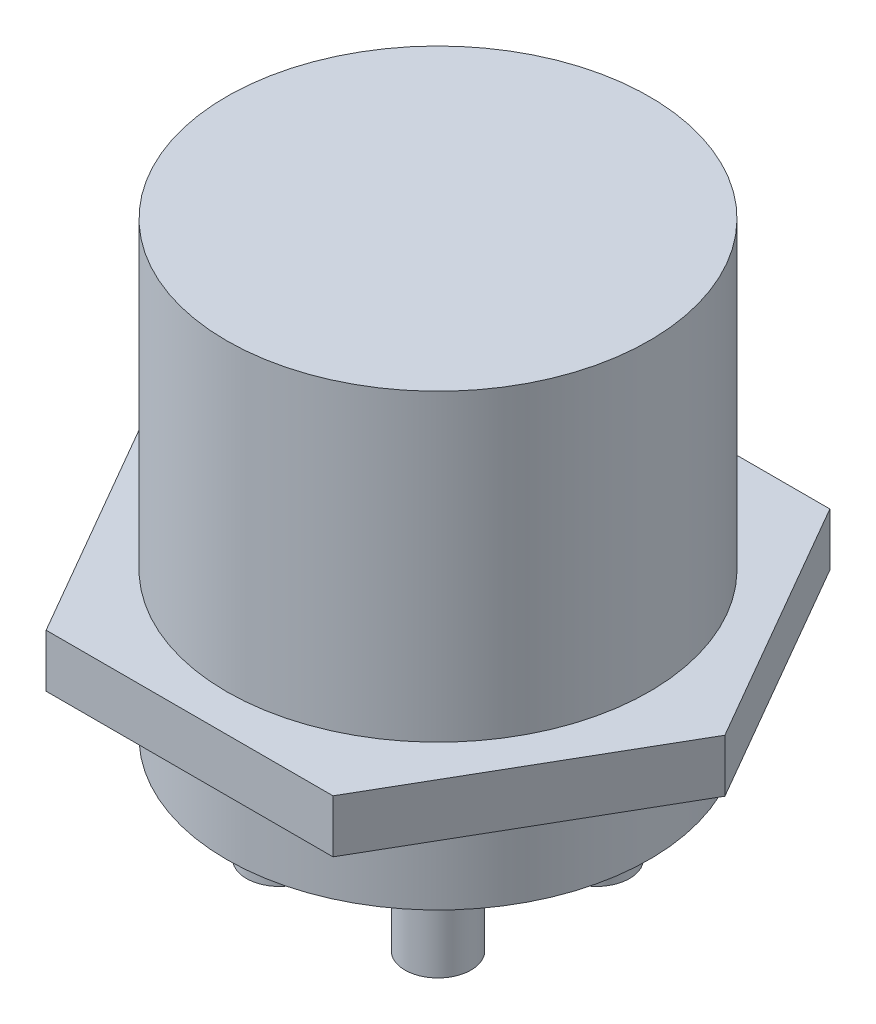
ISO-10303-21;
HEADER;
FILE_DESCRIPTION(('STEP AP214'),'2;1');
FILE_NAME('part.step','',(''),(''),'','','');
FILE_SCHEMA(('AUTOMOTIVE_DESIGN { 1 0 10303 214 1 1 1 1 }'));
ENDSEC;
DATA;
#1=APPLICATION_CONTEXT('core data for automotive mechanical design processes');
#2=APPLICATION_PROTOCOL_DEFINITION('international standard','automotive_design',2000,#1);
#3=PRODUCT_CONTEXT('',#1,'mechanical');
#4=PRODUCT('Part','Part','',(#3));
#5=PRODUCT_RELATED_PRODUCT_CATEGORY('part','',(#4));
#6=PRODUCT_DEFINITION_FORMATION('','',#4);
#7=PRODUCT_DEFINITION_CONTEXT('part definition',#1,'design');
#8=PRODUCT_DEFINITION('design','',#6,#7);
#9=PRODUCT_DEFINITION_SHAPE('','',#8);
#10=(LENGTH_UNIT() NAMED_UNIT(*) SI_UNIT(.MILLI.,.METRE.));
#11=(NAMED_UNIT(*) PLANE_ANGLE_UNIT() SI_UNIT($,.RADIAN.));
#12=(NAMED_UNIT(*) SI_UNIT($,.STERADIAN.) SOLID_ANGLE_UNIT());
#13=UNCERTAINTY_MEASURE_WITH_UNIT(LENGTH_MEASURE(1.E-05),#10,'distance_accuracy_value','');
#14=(GEOMETRIC_REPRESENTATION_CONTEXT(3) GLOBAL_UNCERTAINTY_ASSIGNED_CONTEXT((#13)) GLOBAL_UNIT_ASSIGNED_CONTEXT((#10,
#11,#12)) REPRESENTATION_CONTEXT('',''));
#15=CARTESIAN_POINT('',(0.,0.,0.));
#16=DIRECTION('',(0.,0.,1.));
#17=DIRECTION('',(1.,0.,0.));
#18=AXIS2_PLACEMENT_3D('',#15,#16,#17);
#19=CARTESIAN_POINT('',(5.42709253038248,-5.,9.4));
#20=DIRECTION('',(0.866025403784439,0.,0.5));
#21=DIRECTION('',(0.5,0.,-0.866025403784439));
#22=AXIS2_PLACEMENT_3D('',#19,#20,#21);
#23=PLANE('',#22);
#24=DIRECTION('',(0.5,0.,-0.866025403784439));
#25=VECTOR('',#24,1.);
#26=CARTESIAN_POINT('',(5.42709253038248,-3.,9.4));
#27=LINE('',#26,#25);
#28=CARTESIAN_POINT('',(5.42709253038248,-3.,9.4));
#29=VERTEX_POINT('',#28);
#30=CARTESIAN_POINT('',(10.854185060765,-3.,0.));
#31=VERTEX_POINT('',#30);
#32=EDGE_CURVE('E127',#29,#31,#27,.T.);
#33=ORIENTED_EDGE('',*,*,#32,.F.);
#34=DIRECTION('',(0.,1.,0.));
#35=VECTOR('',#34,1.);
#36=CARTESIAN_POINT('',(5.42709253038248,-5.,9.4));
#37=LINE('',#36,#35);
#38=CARTESIAN_POINT('',(5.42709253038248,-5.,9.4));
#39=VERTEX_POINT('',#38);
#40=EDGE_CURVE('E12',#39,#29,#37,.T.);
#41=ORIENTED_EDGE('',*,*,#40,.F.);
#42=DIRECTION('',(0.5,0.,-0.866025403784439));
#43=VECTOR('',#42,1.);
#44=CARTESIAN_POINT('',(5.42709253038248,-5.,9.4));
#45=LINE('',#44,#43);
#46=CARTESIAN_POINT('',(10.854185060765,-5.,0.));
#47=VERTEX_POINT('',#46);
#48=EDGE_CURVE('E141',#39,#47,#45,.T.);
#49=ORIENTED_EDGE('',*,*,#48,.T.);
#50=DIRECTION('',(0.,1.,0.));
#51=VECTOR('',#50,1.);
#52=CARTESIAN_POINT('',(10.854185060765,-5.,0.));
#53=LINE('',#52,#51);
#54=EDGE_CURVE('E45',#47,#31,#53,.T.);
#55=ORIENTED_EDGE('',*,*,#54,.T.);
#56=EDGE_LOOP('',(#33,#41,#49,#55));
#57=FACE_BOUND('',#56,.T.);
#58=ADVANCED_FACE('F42',(#57),#23,.T.);
#59=CARTESIAN_POINT('',(-5.42709253038248,-5.,9.4));
#60=DIRECTION('',(0.,0.,1.));
#61=DIRECTION('',(1.,0.,0.));
#62=AXIS2_PLACEMENT_3D('',#59,#60,#61);
#63=PLANE('',#62);
#64=DIRECTION('',(1.,0.,0.));
#65=VECTOR('',#64,1.);
#66=CARTESIAN_POINT('',(-5.42709253038248,-3.,9.4));
#67=LINE('',#66,#65);
#68=CARTESIAN_POINT('',(-5.42709253038248,-3.,9.4));
#69=VERTEX_POINT('',#68);
#70=EDGE_CURVE('E139',#69,#29,#67,.T.);
#71=ORIENTED_EDGE('',*,*,#70,.F.);
#72=DIRECTION('',(0.,1.,0.));
#73=VECTOR('',#72,1.);
#74=CARTESIAN_POINT('',(-5.42709253038248,-5.,9.4));
#75=LINE('',#74,#73);
#76=CARTESIAN_POINT('',(-5.42709253038248,-5.,9.4));
#77=VERTEX_POINT('',#76);
#78=EDGE_CURVE('E51',#77,#69,#75,.T.);
#79=ORIENTED_EDGE('',*,*,#78,.F.);
#80=DIRECTION('',(1.,0.,0.));
#81=VECTOR('',#80,1.);
#82=CARTESIAN_POINT('',(-5.42709253038248,-5.,9.4));
#83=LINE('',#82,#81);
#84=EDGE_CURVE('E117',#77,#39,#83,.T.);
#85=ORIENTED_EDGE('',*,*,#84,.T.);
#86=ORIENTED_EDGE('',*,*,#40,.T.);
#87=EDGE_LOOP('',(#71,#79,#85,#86));
#88=FACE_BOUND('',#87,.T.);
#89=ADVANCED_FACE('F149',(#88),#63,.T.);
#90=CARTESIAN_POINT('',(-10.854185060765,-5.,0.));
#91=DIRECTION('',(-0.866025403784439,0.,0.5));
#92=DIRECTION('',(0.5,0.,0.866025403784439));
#93=AXIS2_PLACEMENT_3D('',#90,#91,#92);
#94=PLANE('',#93);
#95=DIRECTION('',(0.5,0.,0.866025403784439));
#96=VECTOR('',#95,1.);
#97=CARTESIAN_POINT('',(-10.854185060765,-3.,0.));
#98=LINE('',#97,#96);
#99=CARTESIAN_POINT('',(-10.854185060765,-3.,0.));
#100=VERTEX_POINT('',#99);
#101=EDGE_CURVE('E104',#100,#69,#98,.T.);
#102=ORIENTED_EDGE('',*,*,#101,.F.);
#103=DIRECTION('',(0.,1.,0.));
#104=VECTOR('',#103,1.);
#105=CARTESIAN_POINT('',(-10.854185060765,-5.,0.));
#106=LINE('',#105,#104);
#107=CARTESIAN_POINT('',(-10.854185060765,-5.,0.));
#108=VERTEX_POINT('',#107);
#109=EDGE_CURVE('E99',#108,#100,#106,.T.);
#110=ORIENTED_EDGE('',*,*,#109,.F.);
#111=DIRECTION('',(0.5,0.,0.866025403784439));
#112=VECTOR('',#111,1.);
#113=CARTESIAN_POINT('',(-10.854185060765,-5.,0.));
#114=LINE('',#113,#112);
#115=EDGE_CURVE('E102',#108,#77,#114,.T.);
#116=ORIENTED_EDGE('',*,*,#115,.T.);
#117=ORIENTED_EDGE('',*,*,#78,.T.);
#118=EDGE_LOOP('',(#102,#110,#116,#117));
#119=FACE_BOUND('',#118,.T.);
#120=ADVANCED_FACE('F101',(#119),#94,.T.);
#121=CARTESIAN_POINT('',(-5.42709253038248,-5.,-9.4));
#122=DIRECTION('',(-0.866025403784439,0.,-0.5));
#123=DIRECTION('',(-0.5,0.,0.866025403784439));
#124=AXIS2_PLACEMENT_3D('',#121,#122,#123);
#125=PLANE('',#124);
#126=DIRECTION('',(-0.5,0.,0.866025403784439));
#127=VECTOR('',#126,1.);
#128=CARTESIAN_POINT('',(-5.42709253038248,-3.,-9.4));
#129=LINE('',#128,#127);
#130=CARTESIAN_POINT('',(-5.42709253038248,-3.,-9.4));
#131=VERTEX_POINT('',#130);
#132=EDGE_CURVE('E136',#131,#100,#129,.T.);
#133=ORIENTED_EDGE('',*,*,#132,.F.);
#134=DIRECTION('',(0.,1.,0.));
#135=VECTOR('',#134,1.);
#136=CARTESIAN_POINT('',(-5.42709253038248,-5.,-9.4));
#137=LINE('',#136,#135);
#138=CARTESIAN_POINT('',(-5.42709253038248,-5.,-9.4));
#139=VERTEX_POINT('',#138);
#140=EDGE_CURVE('E109',#139,#131,#137,.T.);
#141=ORIENTED_EDGE('',*,*,#140,.F.);
#142=DIRECTION('',(-0.5,0.,0.866025403784439));
#143=VECTOR('',#142,1.);
#144=CARTESIAN_POINT('',(-5.42709253038248,-5.,-9.4));
#145=LINE('',#144,#143);
#146=EDGE_CURVE('E115',#139,#108,#145,.T.);
#147=ORIENTED_EDGE('',*,*,#146,.T.);
#148=ORIENTED_EDGE('',*,*,#109,.T.);
#149=EDGE_LOOP('',(#133,#141,#147,#148));
#150=FACE_BOUND('',#149,.T.);
#151=ADVANCED_FACE('F119',(#150),#125,.T.);
#152=CARTESIAN_POINT('',(5.42709253038248,-5.,-9.4));
#153=DIRECTION('',(0.,0.,-1.));
#154=DIRECTION('',(-1.,0.,0.));
#155=AXIS2_PLACEMENT_3D('',#152,#153,#154);
#156=PLANE('',#155);
#157=DIRECTION('',(-1.,0.,0.));
#158=VECTOR('',#157,1.);
#159=CARTESIAN_POINT('',(5.42709253038248,-3.,-9.4));
#160=LINE('',#159,#158);
#161=CARTESIAN_POINT('',(5.42709253038248,-3.,-9.4));
#162=VERTEX_POINT('',#161);
#163=EDGE_CURVE('E133',#162,#131,#160,.T.);
#164=ORIENTED_EDGE('',*,*,#163,.F.);
#165=DIRECTION('',(0.,1.,0.));
#166=VECTOR('',#165,1.);
#167=CARTESIAN_POINT('',(5.42709253038248,-5.,-9.4));
#168=LINE('',#167,#166);
#169=CARTESIAN_POINT('',(5.42709253038248,-5.,-9.4));
#170=VERTEX_POINT('',#169);
#171=EDGE_CURVE('E144',#170,#162,#168,.T.);
#172=ORIENTED_EDGE('',*,*,#171,.F.);
#173=DIRECTION('',(-1.,0.,0.));
#174=VECTOR('',#173,1.);
#175=CARTESIAN_POINT('',(5.42709253038248,-5.,-9.4));
#176=LINE('',#175,#174);
#177=EDGE_CURVE('E120',#170,#139,#176,.T.);
#178=ORIENTED_EDGE('',*,*,#177,.T.);
#179=ORIENTED_EDGE('',*,*,#140,.T.);
#180=EDGE_LOOP('',(#164,#172,#178,#179));
#181=FACE_BOUND('',#180,.T.);
#182=ADVANCED_FACE('F162',(#181),#156,.T.);
#183=CARTESIAN_POINT('',(10.854185060765,-5.,0.));
#184=DIRECTION('',(0.866025403784438,0.,-0.5));
#185=DIRECTION('',(-0.5,0.,-0.866025403784438));
#186=AXIS2_PLACEMENT_3D('',#183,#184,#185);
#187=PLANE('',#186);
#188=DIRECTION('',(-0.5,0.,-0.866025403784438));
#189=VECTOR('',#188,1.);
#190=CARTESIAN_POINT('',(10.854185060765,-3.,0.));
#191=LINE('',#190,#189);
#192=EDGE_CURVE('E130',#31,#162,#191,.T.);
#193=ORIENTED_EDGE('',*,*,#192,.F.);
#194=ORIENTED_EDGE('',*,*,#54,.F.);
#195=DIRECTION('',(-0.5,0.,-0.866025403784438));
#196=VECTOR('',#195,1.);
#197=CARTESIAN_POINT('',(10.854185060765,-5.,0.));
#198=LINE('',#197,#196);
#199=EDGE_CURVE('E122',#47,#170,#198,.T.);
#200=ORIENTED_EDGE('',*,*,#199,.T.);
#201=ORIENTED_EDGE('',*,*,#171,.T.);
#202=EDGE_LOOP('',(#193,#194,#200,#201));
#203=FACE_BOUND('',#202,.T.);
#204=ADVANCED_FACE('F146',(#203),#187,.T.);
#205=CARTESIAN_POINT('',(0.,-5.,0.));
#206=DIRECTION('',(0.,1.,0.));
#207=DIRECTION('',(0.,0.,1.));
#208=AXIS2_PLACEMENT_3D('',#205,#206,#207);
#209=PLANE('',#208);
#210=ORIENTED_EDGE('',*,*,#48,.F.);
#211=ORIENTED_EDGE('',*,*,#84,.F.);
#212=ORIENTED_EDGE('',*,*,#115,.F.);
#213=ORIENTED_EDGE('',*,*,#146,.F.);
#214=ORIENTED_EDGE('',*,*,#177,.F.);
#215=ORIENTED_EDGE('',*,*,#199,.F.);
#216=EDGE_LOOP('',(#210,#211,#212,#213,#214,#215));
#217=FACE_BOUND('',#216,.T.);
#218=ADVANCED_FACE('F113',(#217),#209,.F.);
#219=CARTESIAN_POINT('',(0.,-3.,0.));
#220=DIRECTION('',(0.,1.,0.));
#221=DIRECTION('',(0.,0.,1.));
#222=AXIS2_PLACEMENT_3D('',#219,#220,#221);
#223=PLANE('',#222);
#224=ORIENTED_EDGE('',*,*,#32,.T.);
#225=ORIENTED_EDGE('',*,*,#192,.T.);
#226=ORIENTED_EDGE('',*,*,#163,.T.);
#227=ORIENTED_EDGE('',*,*,#132,.T.);
#228=ORIENTED_EDGE('',*,*,#101,.T.);
#229=ORIENTED_EDGE('',*,*,#70,.T.);
#230=EDGE_LOOP('',(#224,#225,#226,#227,#228,#229));
#231=FACE_BOUND('',#230,.T.);
#232=ADVANCED_FACE('F148',(#231),#223,.T.);
#233=CLOSED_SHELL('',(#58,#89,#120,#151,#182,#204,#218,#232));
#234=MANIFOLD_SOLID_BREP('B2',#233);
#235=CARTESIAN_POINT('',(-3.,-12.5,-3.));
#236=DIRECTION('',(0.,1.,0.));
#237=DIRECTION('',(0.,0.,1.));
#238=AXIS2_PLACEMENT_3D('',#235,#236,#237);
#239=CYLINDRICAL_SURFACE('',#238,1.25);
#240=CARTESIAN_POINT('',(-3.,-12.5,-3.));
#241=DIRECTION('',(0.,-1.,0.));
#242=DIRECTION('',(0.,0.,1.));
#243=AXIS2_PLACEMENT_3D('',#240,#241,#242);
#244=CIRCLE('',#243,1.25);
#245=CARTESIAN_POINT('',(-3.,-12.5,-1.75));
#246=VERTEX_POINT('',#245);
#247=EDGE_CURVE('E41',#246,#246,#244,.T.);
#248=ORIENTED_EDGE('',*,*,#247,.F.);
#249=EDGE_LOOP('',(#248));
#250=FACE_BOUND('',#249,.T.);
#251=CARTESIAN_POINT('',(-3.,-8.5,-3.));
#252=DIRECTION('',(0.,-1.,0.));
#253=DIRECTION('',(0.,0.,1.));
#254=AXIS2_PLACEMENT_3D('',#251,#252,#253);
#255=CIRCLE('',#254,1.25);
#256=CARTESIAN_POINT('',(-3.,-8.5,-1.75));
#257=VERTEX_POINT('',#256);
#258=EDGE_CURVE('E229',#257,#257,#255,.T.);
#259=ORIENTED_EDGE('',*,*,#258,.T.);
#260=EDGE_LOOP('',(#259));
#261=FACE_BOUND('',#260,.T.);
#262=ADVANCED_FACE('F226',(#250,#261),#239,.T.);
#263=CARTESIAN_POINT('',(-3.,-12.5,-3.));
#264=DIRECTION('',(0.,1.,0.));
#265=DIRECTION('',(0.,0.,1.));
#266=AXIS2_PLACEMENT_3D('',#263,#264,#265);
#267=PLANE('',#266);
#268=ORIENTED_EDGE('',*,*,#247,.T.);
#269=EDGE_LOOP('',(#268));
#270=FACE_BOUND('',#269,.T.);
#271=ADVANCED_FACE('F241',(#270),#267,.F.);
#272=CARTESIAN_POINT('',(-3.,-8.5,-3.));
#273=DIRECTION('',(0.,1.,0.));
#274=DIRECTION('',(0.,0.,1.));
#275=AXIS2_PLACEMENT_3D('',#272,#273,#274);
#276=PLANE('',#275);
#277=ORIENTED_EDGE('',*,*,#258,.F.);
#278=EDGE_LOOP('',(#277));
#279=FACE_BOUND('',#278,.T.);
#280=ADVANCED_FACE('F239',(#279),#276,.T.);
#281=CLOSED_SHELL('',(#262,#271,#280));
#282=MANIFOLD_SOLID_BREP('B6',#281);
#283=CARTESIAN_POINT('',(3.,-12.5,-3.));
#284=DIRECTION('',(0.,1.,0.));
#285=DIRECTION('',(0.,0.,1.));
#286=AXIS2_PLACEMENT_3D('',#283,#284,#285);
#287=CYLINDRICAL_SURFACE('',#286,1.25);
#288=CARTESIAN_POINT('',(3.,-12.5,-3.));
#289=DIRECTION('',(0.,-1.,0.));
#290=DIRECTION('',(0.,0.,-1.));
#291=AXIS2_PLACEMENT_3D('',#288,#289,#290);
#292=CIRCLE('',#291,1.25);
#293=CARTESIAN_POINT('',(3.,-12.5,-4.25));
#294=VERTEX_POINT('',#293);
#295=EDGE_CURVE('E225',#294,#294,#292,.T.);
#296=ORIENTED_EDGE('',*,*,#295,.F.);
#297=EDGE_LOOP('',(#296));
#298=FACE_BOUND('',#297,.T.);
#299=CARTESIAN_POINT('',(3.,-8.5,-3.));
#300=DIRECTION('',(0.,-1.,0.));
#301=DIRECTION('',(0.,0.,-1.));
#302=AXIS2_PLACEMENT_3D('',#299,#300,#301);
#303=CIRCLE('',#302,1.25);
#304=CARTESIAN_POINT('',(3.,-8.5,-4.25));
#305=VERTEX_POINT('',#304);
#306=EDGE_CURVE('E278',#305,#305,#303,.T.);
#307=ORIENTED_EDGE('',*,*,#306,.T.);
#308=EDGE_LOOP('',(#307));
#309=FACE_BOUND('',#308,.T.);
#310=ADVANCED_FACE('F275',(#298,#309),#287,.T.);
#311=CARTESIAN_POINT('',(3.,-12.5,-3.));
#312=DIRECTION('',(0.,-1.,0.));
#313=DIRECTION('',(0.,0.,-1.));
#314=AXIS2_PLACEMENT_3D('',#311,#312,#313);
#315=PLANE('',#314);
#316=ORIENTED_EDGE('',*,*,#295,.T.);
#317=EDGE_LOOP('',(#316));
#318=FACE_BOUND('',#317,.T.);
#319=ADVANCED_FACE('F290',(#318),#315,.T.);
#320=CARTESIAN_POINT('',(3.,-8.5,-3.));
#321=DIRECTION('',(0.,-1.,0.));
#322=DIRECTION('',(0.,0.,-1.));
#323=AXIS2_PLACEMENT_3D('',#320,#321,#322);
#324=PLANE('',#323);
#325=ORIENTED_EDGE('',*,*,#306,.F.);
#326=EDGE_LOOP('',(#325));
#327=FACE_BOUND('',#326,.T.);
#328=ADVANCED_FACE('F288',(#327),#324,.F.);
#329=CLOSED_SHELL('',(#310,#319,#328));
#330=MANIFOLD_SOLID_BREP('B36',#329);
#331=CARTESIAN_POINT('',(3.,-12.5,3.));
#332=DIRECTION('',(0.,1.,0.));
#333=DIRECTION('',(0.,0.,1.));
#334=AXIS2_PLACEMENT_3D('',#331,#332,#333);
#335=CYLINDRICAL_SURFACE('',#334,1.25);
#336=CARTESIAN_POINT('',(3.,-12.5,3.));
#337=DIRECTION('',(0.,-1.,0.));
#338=DIRECTION('',(0.,0.,1.));
#339=AXIS2_PLACEMENT_3D('',#336,#337,#338);
#340=CIRCLE('',#339,1.25);
#341=CARTESIAN_POINT('',(3.,-12.5,4.25));
#342=VERTEX_POINT('',#341);
#343=EDGE_CURVE('E274',#342,#342,#340,.T.);
#344=ORIENTED_EDGE('',*,*,#343,.F.);
#345=EDGE_LOOP('',(#344));
#346=FACE_BOUND('',#345,.T.);
#347=CARTESIAN_POINT('',(3.,-8.5,3.));
#348=DIRECTION('',(0.,-1.,0.));
#349=DIRECTION('',(0.,0.,1.));
#350=AXIS2_PLACEMENT_3D('',#347,#348,#349);
#351=CIRCLE('',#350,1.25);
#352=CARTESIAN_POINT('',(3.,-8.5,4.25));
#353=VERTEX_POINT('',#352);
#354=EDGE_CURVE('E327',#353,#353,#351,.T.);
#355=ORIENTED_EDGE('',*,*,#354,.T.);
#356=EDGE_LOOP('',(#355));
#357=FACE_BOUND('',#356,.T.);
#358=ADVANCED_FACE('F324',(#346,#357),#335,.T.);
#359=CARTESIAN_POINT('',(3.,-12.5,3.));
#360=DIRECTION('',(0.,1.,0.));
#361=DIRECTION('',(0.,0.,1.));
#362=AXIS2_PLACEMENT_3D('',#359,#360,#361);
#363=PLANE('',#362);
#364=ORIENTED_EDGE('',*,*,#343,.T.);
#365=EDGE_LOOP('',(#364));
#366=FACE_BOUND('',#365,.T.);
#367=ADVANCED_FACE('F339',(#366),#363,.F.);
#368=CARTESIAN_POINT('',(3.,-8.5,3.));
#369=DIRECTION('',(0.,1.,0.));
#370=DIRECTION('',(0.,0.,1.));
#371=AXIS2_PLACEMENT_3D('',#368,#369,#370);
#372=PLANE('',#371);
#373=ORIENTED_EDGE('',*,*,#354,.F.);
#374=EDGE_LOOP('',(#373));
#375=FACE_BOUND('',#374,.T.);
#376=ADVANCED_FACE('F337',(#375),#372,.T.);
#377=CLOSED_SHELL('',(#358,#367,#376));
#378=MANIFOLD_SOLID_BREP('B220',#377);
#379=CARTESIAN_POINT('',(-3.,-12.5,3.));
#380=DIRECTION('',(0.,1.,0.));
#381=DIRECTION('',(0.,0.,1.));
#382=AXIS2_PLACEMENT_3D('',#379,#380,#381);
#383=CYLINDRICAL_SURFACE('',#382,1.25);
#384=CARTESIAN_POINT('',(-3.,-12.5,3.));
#385=DIRECTION('',(0.,-1.,0.));
#386=DIRECTION('',(0.,0.,-1.));
#387=AXIS2_PLACEMENT_3D('',#384,#385,#386);
#388=CIRCLE('',#387,1.25);
#389=CARTESIAN_POINT('',(-3.,-12.5,1.75));
#390=VERTEX_POINT('',#389);
#391=EDGE_CURVE('E323',#390,#390,#388,.T.);
#392=ORIENTED_EDGE('',*,*,#391,.F.);
#393=EDGE_LOOP('',(#392));
#394=FACE_BOUND('',#393,.T.);
#395=CARTESIAN_POINT('',(-3.,-8.5,3.));
#396=DIRECTION('',(0.,-1.,0.));
#397=DIRECTION('',(0.,0.,-1.));
#398=AXIS2_PLACEMENT_3D('',#395,#396,#397);
#399=CIRCLE('',#398,1.25);
#400=CARTESIAN_POINT('',(-3.,-8.5,1.75));
#401=VERTEX_POINT('',#400);
#402=EDGE_CURVE('E375',#401,#401,#399,.T.);
#403=ORIENTED_EDGE('',*,*,#402,.T.);
#404=EDGE_LOOP('',(#403));
#405=FACE_BOUND('',#404,.T.);
#406=ADVANCED_FACE('F372',(#394,#405),#383,.T.);
#407=CARTESIAN_POINT('',(-3.,-12.5,3.));
#408=DIRECTION('',(0.,-1.,0.));
#409=DIRECTION('',(0.,0.,-1.));
#410=AXIS2_PLACEMENT_3D('',#407,#408,#409);
#411=PLANE('',#410);
#412=ORIENTED_EDGE('',*,*,#391,.T.);
#413=EDGE_LOOP('',(#412));
#414=FACE_BOUND('',#413,.T.);
#415=ADVANCED_FACE('F387',(#414),#411,.T.);
#416=CARTESIAN_POINT('',(-3.,-8.5,3.));
#417=DIRECTION('',(0.,-1.,0.));
#418=DIRECTION('',(0.,0.,-1.));
#419=AXIS2_PLACEMENT_3D('',#416,#417,#418);
#420=PLANE('',#419);
#421=ORIENTED_EDGE('',*,*,#402,.F.);
#422=EDGE_LOOP('',(#421));
#423=FACE_BOUND('',#422,.T.);
#424=ADVANCED_FACE('F385',(#423),#420,.F.);
#425=CLOSED_SHELL('',(#406,#415,#424));
#426=MANIFOLD_SOLID_BREP('B269',#425);
#427=CARTESIAN_POINT('',(0.,8.5,0.));
#428=DIRECTION('',(0.,-1.,0.));
#429=DIRECTION('',(0.,0.,-1.));
#430=AXIS2_PLACEMENT_3D('',#427,#428,#429);
#431=CYLINDRICAL_SURFACE('',#430,8.);
#432=CARTESIAN_POINT('',(0.,8.5,0.));
#433=DIRECTION('',(0.,1.,0.));
#434=DIRECTION('',(0.,0.,1.));
#435=AXIS2_PLACEMENT_3D('',#432,#433,#434);
#436=CIRCLE('',#435,8.);
#437=CARTESIAN_POINT('',(0.,8.5,8.));
#438=VERTEX_POINT('',#437);
#439=EDGE_CURVE('E371',#438,#438,#436,.T.);
#440=ORIENTED_EDGE('',*,*,#439,.F.);
#441=EDGE_LOOP('',(#440));
#442=FACE_BOUND('',#441,.T.);
#443=CARTESIAN_POINT('',(0.,-8.5,0.));
#444=DIRECTION('',(0.,1.,0.));
#445=DIRECTION('',(0.,0.,1.));
#446=AXIS2_PLACEMENT_3D('',#443,#444,#445);
#447=CIRCLE('',#446,8.);
#448=CARTESIAN_POINT('',(0.,-8.5,8.));
#449=VERTEX_POINT('',#448);
#450=EDGE_CURVE('E416',#449,#449,#447,.T.);
#451=ORIENTED_EDGE('',*,*,#450,.T.);
#452=EDGE_LOOP('',(#451));
#453=FACE_BOUND('',#452,.T.);
#454=ADVANCED_FACE('F413',(#442,#453),#431,.T.);
#455=CARTESIAN_POINT('',(0.,8.5,0.));
#456=DIRECTION('',(0.,1.,0.));
#457=DIRECTION('',(0.,0.,1.));
#458=AXIS2_PLACEMENT_3D('',#455,#456,#457);
#459=PLANE('',#458);
#460=ORIENTED_EDGE('',*,*,#439,.T.);
#461=EDGE_LOOP('',(#460));
#462=FACE_BOUND('',#461,.T.);
#463=ADVANCED_FACE('F428',(#462),#459,.T.);
#464=CARTESIAN_POINT('',(0.,-8.5,0.));
#465=DIRECTION('',(0.,1.,0.));
#466=DIRECTION('',(0.,0.,1.));
#467=AXIS2_PLACEMENT_3D('',#464,#465,#466);
#468=PLANE('',#467);
#469=ORIENTED_EDGE('',*,*,#450,.F.);
#470=EDGE_LOOP('',(#469));
#471=FACE_BOUND('',#470,.T.);
#472=ADVANCED_FACE('F426',(#471),#468,.F.);
#473=CLOSED_SHELL('',(#454,#463,#472));
#474=MANIFOLD_SOLID_BREP('B318',#473);
#475=ADVANCED_BREP_SHAPE_REPRESENTATION('',(#18,#234,#282,#330,#378,#426,#474),#14);
#476=SHAPE_DEFINITION_REPRESENTATION(#9,#475);
ENDSEC;
END-ISO-10303-21;
